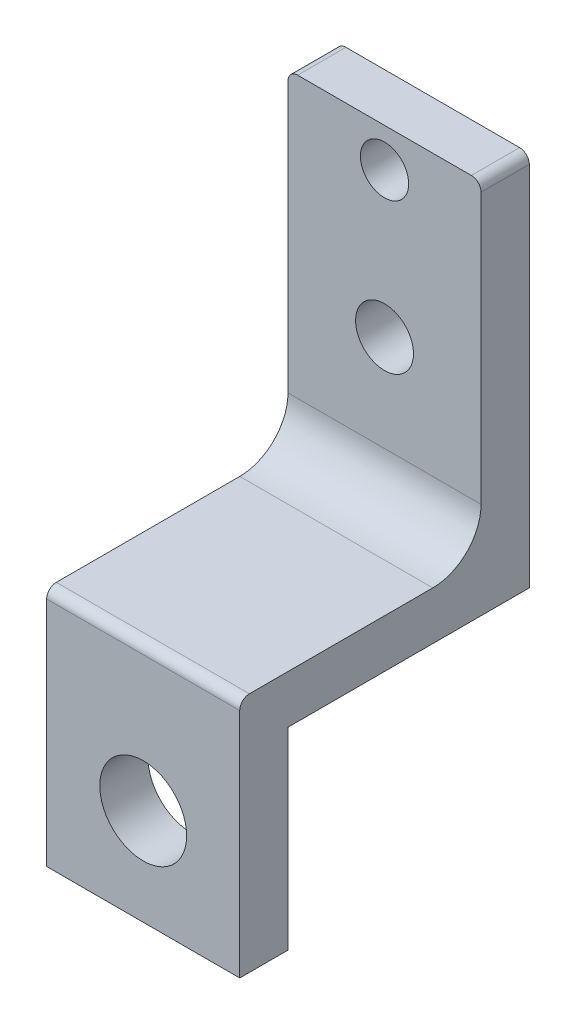
ISO-10303-21;
HEADER;
FILE_DESCRIPTION(('STEP AP214'),'2;1');
FILE_NAME('part.step','',(''),(''),'','','');
FILE_SCHEMA(('AUTOMOTIVE_DESIGN { 1 0 10303 214 1 1 1 1 }'));
ENDSEC;
DATA;
#1=APPLICATION_CONTEXT('core data for automotive mechanical design processes');
#2=APPLICATION_PROTOCOL_DEFINITION('international standard','automotive_design',2000,#1);
#3=PRODUCT_CONTEXT('',#1,'mechanical');
#4=PRODUCT('Part','Part','',(#3));
#5=PRODUCT_RELATED_PRODUCT_CATEGORY('part','',(#4));
#6=PRODUCT_DEFINITION_FORMATION('','',#4);
#7=PRODUCT_DEFINITION_CONTEXT('part definition',#1,'design');
#8=PRODUCT_DEFINITION('design','',#6,#7);
#9=PRODUCT_DEFINITION_SHAPE('','',#8);
#10=(LENGTH_UNIT() NAMED_UNIT(*) SI_UNIT(.MILLI.,.METRE.));
#11=(NAMED_UNIT(*) PLANE_ANGLE_UNIT() SI_UNIT($,.RADIAN.));
#12=(NAMED_UNIT(*) SI_UNIT($,.STERADIAN.) SOLID_ANGLE_UNIT());
#13=UNCERTAINTY_MEASURE_WITH_UNIT(LENGTH_MEASURE(1.E-05),#10,'distance_accuracy_value','');
#14=(GEOMETRIC_REPRESENTATION_CONTEXT(3) GLOBAL_UNCERTAINTY_ASSIGNED_CONTEXT((#13)) GLOBAL_UNIT_ASSIGNED_CONTEXT((#10,
#11,#12)) REPRESENTATION_CONTEXT('',''));
#15=CARTESIAN_POINT('',(0.,0.,0.));
#16=DIRECTION('',(0.,0.,1.));
#17=DIRECTION('',(1.,0.,0.));
#18=AXIS2_PLACEMENT_3D('',#15,#16,#17);
#19=CARTESIAN_POINT('',(0.,0.,0.));
#20=DIRECTION('',(0.,0.,1.));
#21=DIRECTION('',(1.,0.,0.));
#22=AXIS2_PLACEMENT_3D('',#19,#20,#21);
#23=PLANE('',#22);
#24=CARTESIAN_POINT('',(0.,0.,0.));
#25=DIRECTION('',(0.,0.,1.));
#26=DIRECTION('',(1.,0.,0.));
#27=AXIS2_PLACEMENT_3D('',#24,#25,#26);
#28=CIRCLE('',#27,4.5);
#29=CARTESIAN_POINT('',(4.5,0.,0.));
#30=VERTEX_POINT('',#29);
#31=EDGE_CURVE('E144',#30,#30,#28,.T.);
#32=ORIENTED_EDGE('',*,*,#31,.T.);
#33=EDGE_LOOP('',(#32));
#34=FACE_BOUND('',#33,.T.);
#35=DIRECTION('',(-1.,0.,0.));
#36=VECTOR('',#35,1.);
#37=CARTESIAN_POINT('',(10.,10.,0.));
#38=LINE('',#37,#36);
#39=CARTESIAN_POINT('',(10.,9.99999999999999,0.));
#40=VERTEX_POINT('',#39);
#41=CARTESIAN_POINT('',(-9.99999999999999,10.,0.));
#42=VERTEX_POINT('',#41);
#43=EDGE_CURVE('E154',#40,#42,#38,.T.);
#44=ORIENTED_EDGE('',*,*,#43,.F.);
#45=DIRECTION('',(0.,1.,0.));
#46=VECTOR('',#45,1.);
#47=CARTESIAN_POINT('',(10.,49.,0.));
#48=LINE('',#47,#46);
#49=CARTESIAN_POINT('',(10.,-10.,0.));
#50=VERTEX_POINT('',#49);
#51=EDGE_CURVE('E141',#50,#40,#48,.T.);
#52=ORIENTED_EDGE('',*,*,#51,.F.);
#53=DIRECTION('',(1.,0.,0.));
#54=VECTOR('',#53,1.);
#55=CARTESIAN_POINT('',(-10.,-10.,0.));
#56=LINE('',#55,#54);
#57=CARTESIAN_POINT('',(-10.,-10.,0.));
#58=VERTEX_POINT('',#57);
#59=EDGE_CURVE('E166',#58,#50,#56,.T.);
#60=ORIENTED_EDGE('',*,*,#59,.F.);
#61=DIRECTION('',(0.,-1.,0.));
#62=VECTOR('',#61,1.);
#63=CARTESIAN_POINT('',(-10.,10.,0.));
#64=LINE('',#63,#62);
#65=EDGE_CURVE('E172',#42,#58,#64,.T.);
#66=ORIENTED_EDGE('',*,*,#65,.F.);
#67=EDGE_LOOP('',(#44,#52,#60,#66));
#68=FACE_BOUND('',#67,.T.);
#69=ADVANCED_FACE('F36',(#34,#68),#23,.F.);
#70=CARTESIAN_POINT('',(0.,0.,5.));
#71=DIRECTION('',(0.,0.,1.));
#72=DIRECTION('',(1.,0.,0.));
#73=AXIS2_PLACEMENT_3D('',#70,#71,#72);
#74=PLANE('',#73);
#75=DIRECTION('',(0.,1.,0.));
#76=VECTOR('',#75,1.);
#77=CARTESIAN_POINT('',(10.,10.,5.));
#78=LINE('',#77,#76);
#79=CARTESIAN_POINT('',(10.,-10.,5.));
#80=VERTEX_POINT('',#79);
#81=CARTESIAN_POINT('',(10.,14.,5.));
#82=VERTEX_POINT('',#81);
#83=EDGE_CURVE('E163',#80,#82,#78,.T.);
#84=ORIENTED_EDGE('',*,*,#83,.T.);
#85=DIRECTION('',(1.,0.,0.));
#86=VECTOR('',#85,1.);
#87=CARTESIAN_POINT('',(-10.,14.,5.));
#88=LINE('',#87,#86);
#89=CARTESIAN_POINT('',(-10.,14.,5.));
#90=VERTEX_POINT('',#89);
#91=EDGE_CURVE('E11',#82,#90,#88,.F.);
#92=ORIENTED_EDGE('',*,*,#91,.T.);
#93=DIRECTION('',(0.,-1.,0.));
#94=VECTOR('',#93,1.);
#95=CARTESIAN_POINT('',(-10.,49.,5.));
#96=LINE('',#95,#94);
#97=CARTESIAN_POINT('',(-10.,-10.,5.));
#98=VERTEX_POINT('',#97);
#99=EDGE_CURVE('E165',#90,#98,#96,.T.);
#100=ORIENTED_EDGE('',*,*,#99,.T.);
#101=DIRECTION('',(1.,0.,0.));
#102=VECTOR('',#101,1.);
#103=CARTESIAN_POINT('',(-10.,-10.,5.));
#104=LINE('',#103,#102);
#105=EDGE_CURVE('E168',#98,#80,#104,.T.);
#106=ORIENTED_EDGE('',*,*,#105,.T.);
#107=EDGE_LOOP('',(#84,#92,#100,#106));
#108=FACE_BOUND('',#107,.T.);
#109=CARTESIAN_POINT('',(0.,0.,5.));
#110=DIRECTION('',(0.,0.,1.));
#111=DIRECTION('',(1.,0.,0.));
#112=AXIS2_PLACEMENT_3D('',#109,#110,#111);
#113=CIRCLE('',#112,4.5);
#114=CARTESIAN_POINT('',(4.5,0.,5.));
#115=VERTEX_POINT('',#114);
#116=EDGE_CURVE('E158',#115,#115,#113,.T.);
#117=ORIENTED_EDGE('',*,*,#116,.F.);
#118=EDGE_LOOP('',(#117));
#119=FACE_BOUND('',#118,.T.);
#120=ADVANCED_FACE('F260',(#108,#119),#74,.T.);
#121=CARTESIAN_POINT('',(10.,49.,5.));
#122=DIRECTION('',(-1.,0.,0.));
#123=DIRECTION('',(0.,-1.,0.));
#124=AXIS2_PLACEMENT_3D('',#121,#122,#123);
#125=PLANE('',#124);
#126=DIRECTION('',(0.,-1.,0.));
#127=VECTOR('',#126,1.);
#128=CARTESIAN_POINT('',(10.,49.,-25.));
#129=LINE('',#128,#127);
#130=CARTESIAN_POINT('',(10.,48.,-25.));
#131=VERTEX_POINT('',#130);
#132=CARTESIAN_POINT('',(10.,10.,-25.));
#133=VERTEX_POINT('',#132);
#134=EDGE_CURVE('E124',#131,#133,#129,.T.);
#135=ORIENTED_EDGE('',*,*,#134,.F.);
#136=DIRECTION('',(0.,0.,-1.));
#137=VECTOR('',#136,1.);
#138=CARTESIAN_POINT('',(10.,48.,5.));
#139=LINE('',#138,#137);
#140=CARTESIAN_POINT('',(10.,48.,-20.));
#141=VERTEX_POINT('',#140);
#142=EDGE_CURVE('E214',#131,#141,#139,.F.);
#143=ORIENTED_EDGE('',*,*,#142,.T.);
#144=DIRECTION('',(0.,1.,0.));
#145=VECTOR('',#144,1.);
#146=CARTESIAN_POINT('',(10.,49.,-20.));
#147=LINE('',#146,#145);
#148=CARTESIAN_POINT('',(10.,20.,-20.));
#149=VERTEX_POINT('',#148);
#150=EDGE_CURVE('E222',#149,#141,#147,.T.);
#151=ORIENTED_EDGE('',*,*,#150,.F.);
#152=CARTESIAN_POINT('',(10.,20.,-15.));
#153=DIRECTION('',(-1.,0.,0.));
#154=DIRECTION('',(0.,-1.,0.));
#155=AXIS2_PLACEMENT_3D('',#152,#153,#154);
#156=CIRCLE('',#155,5.);
#157=CARTESIAN_POINT('',(10.,15.,-15.));
#158=VERTEX_POINT('',#157);
#159=EDGE_CURVE('E191',#149,#158,#156,.T.);
#160=ORIENTED_EDGE('',*,*,#159,.T.);
#161=DIRECTION('',(0.,0.,-1.));
#162=VECTOR('',#161,1.);
#163=CARTESIAN_POINT('',(10.,15.,0.));
#164=LINE('',#163,#162);
#165=CARTESIAN_POINT('',(10.,15.,4.));
#166=VERTEX_POINT('',#165);
#167=EDGE_CURVE('E218',#166,#158,#164,.T.);
#168=ORIENTED_EDGE('',*,*,#167,.F.);
#169=CARTESIAN_POINT('',(10.,14.,4.));
#170=DIRECTION('',(-1.,0.,0.));
#171=DIRECTION('',(0.,-1.,0.));
#172=AXIS2_PLACEMENT_3D('',#169,#170,#171);
#173=CIRCLE('',#172,1.);
#174=EDGE_CURVE('E51',#166,#82,#173,.F.);
#175=ORIENTED_EDGE('',*,*,#174,.T.);
#176=ORIENTED_EDGE('',*,*,#83,.F.);
#177=DIRECTION('',(0.,0.,-1.));
#178=VECTOR('',#177,1.);
#179=CARTESIAN_POINT('',(10.,-10.,5.));
#180=LINE('',#179,#178);
#181=EDGE_CURVE('E170',#80,#50,#180,.T.);
#182=ORIENTED_EDGE('',*,*,#181,.T.);
#183=ORIENTED_EDGE('',*,*,#51,.T.);
#184=DIRECTION('',(0.,0.,1.));
#185=VECTOR('',#184,1.);
#186=CARTESIAN_POINT('',(10.,10.,-25.));
#187=LINE('',#186,#185);
#188=EDGE_CURVE('E138',#133,#40,#187,.T.);
#189=ORIENTED_EDGE('',*,*,#188,.F.);
#190=EDGE_LOOP('',(#135,#143,#151,#160,#168,#175,#176,#182,#183,#189));
#191=FACE_BOUND('',#190,.T.);
#192=ADVANCED_FACE('F139',(#191),#125,.F.);
#193=CARTESIAN_POINT('',(10.,49.,5.));
#194=DIRECTION('',(0.,-1.,0.));
#195=DIRECTION('',(0.,0.,-1.));
#196=AXIS2_PLACEMENT_3D('',#193,#194,#195);
#197=PLANE('',#196);
#198=DIRECTION('',(1.,0.,0.));
#199=VECTOR('',#198,1.);
#200=CARTESIAN_POINT('',(10.,49.,-25.));
#201=LINE('',#200,#199);
#202=CARTESIAN_POINT('',(-9.00000000000001,49.,-25.));
#203=VERTEX_POINT('',#202);
#204=CARTESIAN_POINT('',(9.00000000000001,49.,-25.));
#205=VERTEX_POINT('',#204);
#206=EDGE_CURVE('E134',#203,#205,#201,.T.);
#207=ORIENTED_EDGE('',*,*,#206,.F.);
#208=DIRECTION('',(0.,0.,-1.));
#209=VECTOR('',#208,1.);
#210=CARTESIAN_POINT('',(-9.00000000000001,49.,5.));
#211=LINE('',#210,#209);
#212=CARTESIAN_POINT('',(-9.00000000000001,49.,-20.));
#213=VERTEX_POINT('',#212);
#214=EDGE_CURVE('E207',#203,#213,#211,.F.);
#215=ORIENTED_EDGE('',*,*,#214,.T.);
#216=DIRECTION('',(1.,0.,0.));
#217=VECTOR('',#216,1.);
#218=CARTESIAN_POINT('',(-20.,49.,-20.));
#219=LINE('',#218,#217);
#220=CARTESIAN_POINT('',(9.00000000000001,49.,-20.));
#221=VERTEX_POINT('',#220);
#222=EDGE_CURVE('E156',#213,#221,#219,.T.);
#223=ORIENTED_EDGE('',*,*,#222,.T.);
#224=DIRECTION('',(0.,0.,-1.));
#225=VECTOR('',#224,1.);
#226=CARTESIAN_POINT('',(9.00000000000001,49.,5.));
#227=LINE('',#226,#225);
#228=EDGE_CURVE('E204',#221,#205,#227,.T.);
#229=ORIENTED_EDGE('',*,*,#228,.T.);
#230=EDGE_LOOP('',(#207,#215,#223,#229));
#231=FACE_BOUND('',#230,.T.);
#232=ADVANCED_FACE('F234',(#231),#197,.F.);
#233=CARTESIAN_POINT('',(-10.,10.,5.));
#234=DIRECTION('',(1.,0.,0.));
#235=DIRECTION('',(0.,1.,0.));
#236=AXIS2_PLACEMENT_3D('',#233,#234,#235);
#237=PLANE('',#236);
#238=DIRECTION('',(0.,1.,0.));
#239=VECTOR('',#238,1.);
#240=CARTESIAN_POINT('',(-10.,10.,-20.));
#241=LINE('',#240,#239);
#242=CARTESIAN_POINT('',(-10.,20.,-20.));
#243=VERTEX_POINT('',#242);
#244=CARTESIAN_POINT('',(-10.,48.,-20.));
#245=VERTEX_POINT('',#244);
#246=EDGE_CURVE('E180',#243,#245,#241,.T.);
#247=ORIENTED_EDGE('',*,*,#246,.T.);
#248=DIRECTION('',(0.,0.,-1.));
#249=VECTOR('',#248,1.);
#250=CARTESIAN_POINT('',(-10.,48.,5.));
#251=LINE('',#250,#249);
#252=CARTESIAN_POINT('',(-9.99999999999999,48.,-25.));
#253=VERTEX_POINT('',#252);
#254=EDGE_CURVE('E198',#245,#253,#251,.T.);
#255=ORIENTED_EDGE('',*,*,#254,.T.);
#256=DIRECTION('',(0.,1.,0.));
#257=VECTOR('',#256,1.);
#258=CARTESIAN_POINT('',(-9.99999999999999,49.,-25.));
#259=LINE('',#258,#257);
#260=CARTESIAN_POINT('',(-9.99999999999999,10.,-25.));
#261=VERTEX_POINT('',#260);
#262=EDGE_CURVE('E155',#261,#253,#259,.T.);
#263=ORIENTED_EDGE('',*,*,#262,.F.);
#264=DIRECTION('',(0.,0.,1.));
#265=VECTOR('',#264,1.);
#266=CARTESIAN_POINT('',(-9.99999999999999,10.,-25.));
#267=LINE('',#266,#265);
#268=EDGE_CURVE('E145',#261,#42,#267,.T.);
#269=ORIENTED_EDGE('',*,*,#268,.T.);
#270=ORIENTED_EDGE('',*,*,#65,.T.);
#271=DIRECTION('',(0.,0.,-1.));
#272=VECTOR('',#271,1.);
#273=CARTESIAN_POINT('',(-10.,-10.,5.));
#274=LINE('',#273,#272);
#275=EDGE_CURVE('E177',#98,#58,#274,.T.);
#276=ORIENTED_EDGE('',*,*,#275,.F.);
#277=ORIENTED_EDGE('',*,*,#99,.F.);
#278=CARTESIAN_POINT('',(-10.,14.,4.));
#279=DIRECTION('',(1.,0.,0.));
#280=DIRECTION('',(0.,1.,0.));
#281=AXIS2_PLACEMENT_3D('',#278,#279,#280);
#282=CIRCLE('',#281,1.);
#283=CARTESIAN_POINT('',(-10.,15.,4.));
#284=VERTEX_POINT('',#283);
#285=EDGE_CURVE('E196',#90,#284,#282,.F.);
#286=ORIENTED_EDGE('',*,*,#285,.T.);
#287=DIRECTION('',(0.,0.,-1.));
#288=VECTOR('',#287,1.);
#289=CARTESIAN_POINT('',(-10.,15.,5.));
#290=LINE('',#289,#288);
#291=CARTESIAN_POINT('',(-10.,15.,-15.));
#292=VERTEX_POINT('',#291);
#293=EDGE_CURVE('E183',#284,#292,#290,.T.);
#294=ORIENTED_EDGE('',*,*,#293,.T.);
#295=CARTESIAN_POINT('',(-10.,20.,-15.));
#296=DIRECTION('',(1.,0.,0.));
#297=DIRECTION('',(0.,1.,0.));
#298=AXIS2_PLACEMENT_3D('',#295,#296,#297);
#299=CIRCLE('',#298,5.);
#300=EDGE_CURVE('E194',#292,#243,#299,.T.);
#301=ORIENTED_EDGE('',*,*,#300,.T.);
#302=EDGE_LOOP('',(#247,#255,#263,#269,#270,#276,#277,#286,#294,#301));
#303=FACE_BOUND('',#302,.T.);
#304=ADVANCED_FACE('F246',(#303),#237,.F.);
#305=CARTESIAN_POINT('',(-10.,-10.,5.));
#306=DIRECTION('',(0.,1.,0.));
#307=DIRECTION('',(0.,0.,1.));
#308=AXIS2_PLACEMENT_3D('',#305,#306,#307);
#309=PLANE('',#308);
#310=ORIENTED_EDGE('',*,*,#59,.T.);
#311=ORIENTED_EDGE('',*,*,#181,.F.);
#312=ORIENTED_EDGE('',*,*,#105,.F.);
#313=ORIENTED_EDGE('',*,*,#275,.T.);
#314=EDGE_LOOP('',(#310,#311,#312,#313));
#315=FACE_BOUND('',#314,.T.);
#316=ADVANCED_FACE('F271',(#315),#309,.F.);
#317=CARTESIAN_POINT('',(0.,0.,5.));
#318=DIRECTION('',(0.,0.,-1.));
#319=DIRECTION('',(-1.,0.,0.));
#320=AXIS2_PLACEMENT_3D('',#317,#318,#319);
#321=CYLINDRICAL_SURFACE('',#320,4.5);
#322=ORIENTED_EDGE('',*,*,#116,.T.);
#323=EDGE_LOOP('',(#322));
#324=FACE_BOUND('',#323,.T.);
#325=ORIENTED_EDGE('',*,*,#31,.F.);
#326=EDGE_LOOP('',(#325));
#327=FACE_BOUND('',#326,.T.);
#328=ADVANCED_FACE('F274',(#324,#327),#321,.F.);
#329=CARTESIAN_POINT('',(10.,10.,-25.));
#330=DIRECTION('',(0.,1.,0.));
#331=DIRECTION('',(0.,0.,1.));
#332=AXIS2_PLACEMENT_3D('',#329,#330,#331);
#333=PLANE('',#332);
#334=ORIENTED_EDGE('',*,*,#43,.T.);
#335=ORIENTED_EDGE('',*,*,#268,.F.);
#336=DIRECTION('',(-1.,0.,0.));
#337=VECTOR('',#336,1.);
#338=CARTESIAN_POINT('',(10.,10.,-25.));
#339=LINE('',#338,#337);
#340=EDGE_CURVE('E129',#133,#261,#339,.T.);
#341=ORIENTED_EDGE('',*,*,#340,.F.);
#342=ORIENTED_EDGE('',*,*,#188,.T.);
#343=EDGE_LOOP('',(#334,#335,#341,#342));
#344=FACE_BOUND('',#343,.T.);
#345=ADVANCED_FACE('F147',(#344),#333,.F.);
#346=CARTESIAN_POINT('',(0.,0.,-25.));
#347=DIRECTION('',(0.,0.,-1.));
#348=DIRECTION('',(-1.,0.,0.));
#349=AXIS2_PLACEMENT_3D('',#346,#347,#348);
#350=PLANE('',#349);
#351=CARTESIAN_POINT('',(0.,45.,-25.));
#352=DIRECTION('',(0.,0.,-1.));
#353=DIRECTION('',(-1.,0.,0.));
#354=AXIS2_PLACEMENT_3D('',#351,#352,#353);
#355=CIRCLE('',#354,2.5);
#356=CARTESIAN_POINT('',(-2.5,45.,-25.));
#357=VERTEX_POINT('',#356);
#358=EDGE_CURVE('E227',#357,#357,#355,.T.);
#359=ORIENTED_EDGE('',*,*,#358,.F.);
#360=EDGE_LOOP('',(#359));
#361=FACE_BOUND('',#360,.T.);
#362=CARTESIAN_POINT('',(0.,30.,-25.));
#363=DIRECTION('',(0.,0.,-1.));
#364=DIRECTION('',(-1.,0.,0.));
#365=AXIS2_PLACEMENT_3D('',#362,#363,#364);
#366=CIRCLE('',#365,3.);
#367=CARTESIAN_POINT('',(-3.,30.,-25.));
#368=VERTEX_POINT('',#367);
#369=EDGE_CURVE('E429',#368,#368,#366,.T.);
#370=ORIENTED_EDGE('',*,*,#369,.F.);
#371=EDGE_LOOP('',(#370));
#372=FACE_BOUND('',#371,.T.);
#373=ORIENTED_EDGE('',*,*,#262,.T.);
#374=CARTESIAN_POINT('',(-9.00000000000001,48.,-25.));
#375=DIRECTION('',(0.,0.,-1.));
#376=DIRECTION('',(-1.,0.,0.));
#377=AXIS2_PLACEMENT_3D('',#374,#375,#376);
#378=CIRCLE('',#377,1.);
#379=EDGE_CURVE('E202',#253,#203,#378,.T.);
#380=ORIENTED_EDGE('',*,*,#379,.T.);
#381=ORIENTED_EDGE('',*,*,#206,.T.);
#382=CARTESIAN_POINT('',(9.00000000000001,48.,-25.));
#383=DIRECTION('',(0.,0.,-1.));
#384=DIRECTION('',(-1.,0.,0.));
#385=AXIS2_PLACEMENT_3D('',#382,#383,#384);
#386=CIRCLE('',#385,1.);
#387=EDGE_CURVE('E132',#205,#131,#386,.T.);
#388=ORIENTED_EDGE('',*,*,#387,.T.);
#389=ORIENTED_EDGE('',*,*,#134,.T.);
#390=ORIENTED_EDGE('',*,*,#340,.T.);
#391=EDGE_LOOP('',(#373,#380,#381,#388,#389,#390));
#392=FACE_BOUND('',#391,.T.);
#393=ADVANCED_FACE('F127',(#361,#372,#392),#350,.T.);
#394=CARTESIAN_POINT('',(-20.,15.,0.));
#395=DIRECTION('',(0.,-1.,0.));
#396=DIRECTION('',(1.,0.,0.));
#397=AXIS2_PLACEMENT_3D('',#394,#395,#396);
#398=PLANE('',#397);
#399=ORIENTED_EDGE('',*,*,#293,.F.);
#400=DIRECTION('',(1.,0.,0.));
#401=VECTOR('',#400,1.);
#402=CARTESIAN_POINT('',(10.,15.,4.));
#403=LINE('',#402,#401);
#404=EDGE_CURVE('E44',#284,#166,#403,.T.);
#405=ORIENTED_EDGE('',*,*,#404,.T.);
#406=ORIENTED_EDGE('',*,*,#167,.T.);
#407=DIRECTION('',(1.,0.,0.));
#408=VECTOR('',#407,1.);
#409=CARTESIAN_POINT('',(-10.,15.,-15.));
#410=LINE('',#409,#408);
#411=EDGE_CURVE('E188',#158,#292,#410,.F.);
#412=ORIENTED_EDGE('',*,*,#411,.T.);
#413=EDGE_LOOP('',(#399,#405,#406,#412));
#414=FACE_BOUND('',#413,.T.);
#415=ADVANCED_FACE('F217',(#414),#398,.F.);
#416=CARTESIAN_POINT('',(-20.,49.,-20.));
#417=DIRECTION('',(0.,0.,-1.));
#418=DIRECTION('',(-1.,0.,0.));
#419=AXIS2_PLACEMENT_3D('',#416,#417,#418);
#420=PLANE('',#419);
#421=CARTESIAN_POINT('',(0.,45.,-20.));
#422=DIRECTION('',(0.,0.,1.));
#423=DIRECTION('',(1.,0.,0.));
#424=AXIS2_PLACEMENT_3D('',#421,#422,#423);
#425=CIRCLE('',#424,2.5);
#426=CARTESIAN_POINT('',(2.5,45.,-20.));
#427=VERTEX_POINT('',#426);
#428=EDGE_CURVE('E430',#427,#427,#425,.T.);
#429=ORIENTED_EDGE('',*,*,#428,.F.);
#430=EDGE_LOOP('',(#429));
#431=FACE_BOUND('',#430,.T.);
#432=CARTESIAN_POINT('',(0.,30.,-20.));
#433=DIRECTION('',(0.,0.,1.));
#434=DIRECTION('',(1.,0.,0.));
#435=AXIS2_PLACEMENT_3D('',#432,#433,#434);
#436=CIRCLE('',#435,3.);
#437=CARTESIAN_POINT('',(3.,30.,-20.));
#438=VERTEX_POINT('',#437);
#439=EDGE_CURVE('E433',#438,#438,#436,.T.);
#440=ORIENTED_EDGE('',*,*,#439,.F.);
#441=EDGE_LOOP('',(#440));
#442=FACE_BOUND('',#441,.T.);
#443=ORIENTED_EDGE('',*,*,#222,.F.);
#444=CARTESIAN_POINT('',(-9.00000000000001,48.,-20.));
#445=DIRECTION('',(0.,0.,-1.));
#446=DIRECTION('',(-1.,0.,0.));
#447=AXIS2_PLACEMENT_3D('',#444,#445,#446);
#448=CIRCLE('',#447,1.);
#449=EDGE_CURVE('E211',#213,#245,#448,.F.);
#450=ORIENTED_EDGE('',*,*,#449,.T.);
#451=ORIENTED_EDGE('',*,*,#246,.F.);
#452=DIRECTION('',(1.,0.,0.));
#453=VECTOR('',#452,1.);
#454=CARTESIAN_POINT('',(10.,20.,-20.));
#455=LINE('',#454,#453);
#456=EDGE_CURVE('E185',#243,#149,#455,.T.);
#457=ORIENTED_EDGE('',*,*,#456,.T.);
#458=ORIENTED_EDGE('',*,*,#150,.T.);
#459=CARTESIAN_POINT('',(9.00000000000001,48.,-20.));
#460=DIRECTION('',(0.,0.,-1.));
#461=DIRECTION('',(-1.,0.,0.));
#462=AXIS2_PLACEMENT_3D('',#459,#460,#461);
#463=CIRCLE('',#462,1.);
#464=EDGE_CURVE('E209',#141,#221,#463,.F.);
#465=ORIENTED_EDGE('',*,*,#464,.T.);
#466=EDGE_LOOP('',(#443,#450,#451,#457,#458,#465));
#467=FACE_BOUND('',#466,.T.);
#468=ADVANCED_FACE('F243',(#431,#442,#467),#420,.F.);
#469=CARTESIAN_POINT('',(0.,30.,-50.));
#470=DIRECTION('',(0.,0.,1.));
#471=DIRECTION('',(1.,0.,0.));
#472=AXIS2_PLACEMENT_3D('',#469,#470,#471);
#473=CYLINDRICAL_SURFACE('',#472,3.);
#474=ORIENTED_EDGE('',*,*,#369,.T.);
#475=EDGE_LOOP('',(#474));
#476=FACE_BOUND('',#475,.T.);
#477=ORIENTED_EDGE('',*,*,#439,.T.);
#478=EDGE_LOOP('',(#477));
#479=FACE_BOUND('',#478,.T.);
#480=ADVANCED_FACE('F287',(#476,#479),#473,.F.);
#481=CARTESIAN_POINT('',(0.,45.,-50.));
#482=DIRECTION('',(0.,0.,1.));
#483=DIRECTION('',(1.,0.,0.));
#484=AXIS2_PLACEMENT_3D('',#481,#482,#483);
#485=CYLINDRICAL_SURFACE('',#484,2.5);
#486=ORIENTED_EDGE('',*,*,#358,.T.);
#487=EDGE_LOOP('',(#486));
#488=FACE_BOUND('',#487,.T.);
#489=ORIENTED_EDGE('',*,*,#428,.T.);
#490=EDGE_LOOP('',(#489));
#491=FACE_BOUND('',#490,.T.);
#492=ADVANCED_FACE('F283',(#488,#491),#485,.F.);
#493=CARTESIAN_POINT('',(-20.,20.,-15.));
#494=DIRECTION('',(-1.,0.,0.));
#495=DIRECTION('',(0.,-1.,0.));
#496=AXIS2_PLACEMENT_3D('',#493,#494,#495);
#497=CYLINDRICAL_SURFACE('',#496,5.);
#498=ORIENTED_EDGE('',*,*,#300,.F.);
#499=ORIENTED_EDGE('',*,*,#411,.F.);
#500=ORIENTED_EDGE('',*,*,#159,.F.);
#501=ORIENTED_EDGE('',*,*,#456,.F.);
#502=EDGE_LOOP('',(#498,#499,#500,#501));
#503=FACE_BOUND('',#502,.T.);
#504=ADVANCED_FACE('F249',(#503),#497,.F.);
#505=CARTESIAN_POINT('',(-9.00000000000001,48.,5.));
#506=DIRECTION('',(0.,0.,-1.));
#507=DIRECTION('',(-1.,0.,0.));
#508=AXIS2_PLACEMENT_3D('',#505,#506,#507);
#509=CYLINDRICAL_SURFACE('',#508,1.);
#510=ORIENTED_EDGE('',*,*,#449,.F.);
#511=ORIENTED_EDGE('',*,*,#214,.F.);
#512=ORIENTED_EDGE('',*,*,#379,.F.);
#513=ORIENTED_EDGE('',*,*,#254,.F.);
#514=EDGE_LOOP('',(#510,#511,#512,#513));
#515=FACE_BOUND('',#514,.T.);
#516=ADVANCED_FACE('F239',(#515),#509,.T.);
#517=CARTESIAN_POINT('',(9.00000000000001,48.,5.));
#518=DIRECTION('',(0.,0.,-1.));
#519=DIRECTION('',(-1.,0.,0.));
#520=AXIS2_PLACEMENT_3D('',#517,#518,#519);
#521=CYLINDRICAL_SURFACE('',#520,1.);
#522=ORIENTED_EDGE('',*,*,#464,.F.);
#523=ORIENTED_EDGE('',*,*,#142,.F.);
#524=ORIENTED_EDGE('',*,*,#387,.F.);
#525=ORIENTED_EDGE('',*,*,#228,.F.);
#526=EDGE_LOOP('',(#522,#523,#524,#525));
#527=FACE_BOUND('',#526,.T.);
#528=ADVANCED_FACE('F252',(#527),#521,.T.);
#529=CARTESIAN_POINT('',(-20.,14.,4.));
#530=DIRECTION('',(-1.,0.,0.));
#531=DIRECTION('',(0.,-1.,0.));
#532=AXIS2_PLACEMENT_3D('',#529,#530,#531);
#533=CYLINDRICAL_SURFACE('',#532,1.);
#534=ORIENTED_EDGE('',*,*,#285,.F.);
#535=ORIENTED_EDGE('',*,*,#91,.F.);
#536=ORIENTED_EDGE('',*,*,#174,.F.);
#537=ORIENTED_EDGE('',*,*,#404,.F.);
#538=EDGE_LOOP('',(#534,#535,#536,#537));
#539=FACE_BOUND('',#538,.T.);
#540=ADVANCED_FACE('F38',(#539),#533,.T.);
#541=CLOSED_SHELL('',(#69,#120,#192,#232,#304,#316,#328,#345,#393,#415,#468,#480,#492,#504,#516,
#528,#540));
#542=MANIFOLD_SOLID_BREP('B2',#541);
#543=ADVANCED_BREP_SHAPE_REPRESENTATION('',(#18,#542),#14);
#544=SHAPE_DEFINITION_REPRESENTATION(#9,#543);
ENDSEC;
END-ISO-10303-21;
